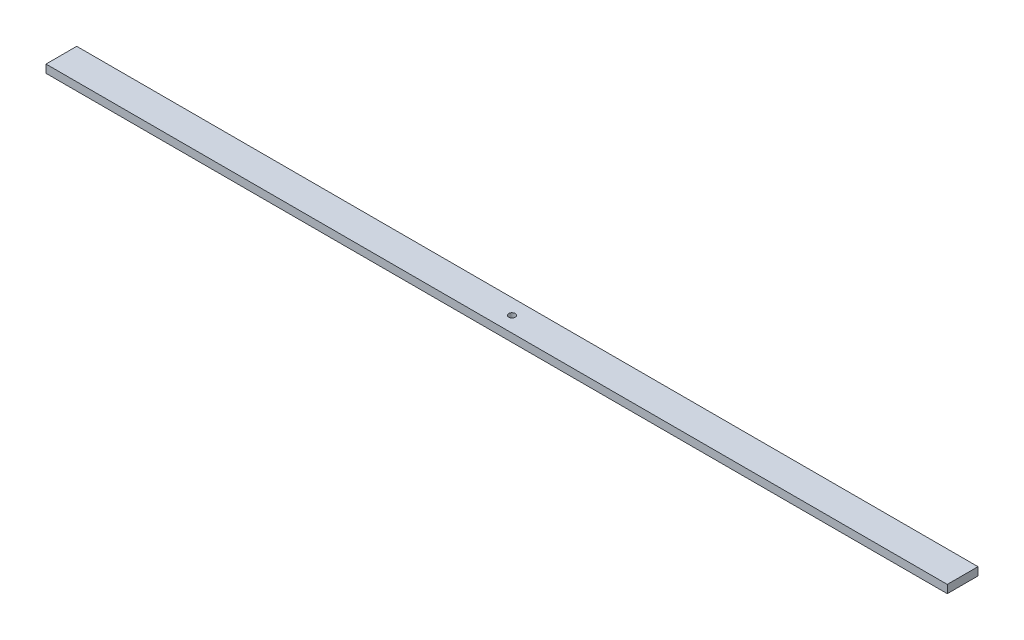
ISO-10303-21;
HEADER;
FILE_DESCRIPTION(('STEP AP214'),'2;1');
FILE_NAME('part.step','',(''),(''),'','','');
FILE_SCHEMA(('AUTOMOTIVE_DESIGN { 1 0 10303 214 1 1 1 1 }'));
ENDSEC;
DATA;
#1=APPLICATION_CONTEXT('core data for automotive mechanical design processes');
#2=APPLICATION_PROTOCOL_DEFINITION('international standard','automotive_design',2000,#1);
#3=PRODUCT_CONTEXT('',#1,'mechanical');
#4=PRODUCT('Part','Part','',(#3));
#5=PRODUCT_RELATED_PRODUCT_CATEGORY('part','',(#4));
#6=PRODUCT_DEFINITION_FORMATION('','',#4);
#7=PRODUCT_DEFINITION_CONTEXT('part definition',#1,'design');
#8=PRODUCT_DEFINITION('design','',#6,#7);
#9=PRODUCT_DEFINITION_SHAPE('','',#8);
#10=(LENGTH_UNIT() NAMED_UNIT(*) SI_UNIT(.MILLI.,.METRE.));
#11=(NAMED_UNIT(*) PLANE_ANGLE_UNIT() SI_UNIT($,.RADIAN.));
#12=(NAMED_UNIT(*) SI_UNIT($,.STERADIAN.) SOLID_ANGLE_UNIT());
#13=UNCERTAINTY_MEASURE_WITH_UNIT(LENGTH_MEASURE(1.E-05),#10,'distance_accuracy_value','');
#14=(GEOMETRIC_REPRESENTATION_CONTEXT(3) GLOBAL_UNCERTAINTY_ASSIGNED_CONTEXT((#13)) GLOBAL_UNIT_ASSIGNED_CONTEXT((#10,
#11,#12)) REPRESENTATION_CONTEXT('',''));
#15=CARTESIAN_POINT('',(0.,0.,0.));
#16=DIRECTION('',(0.,0.,1.));
#17=DIRECTION('',(1.,0.,0.));
#18=AXIS2_PLACEMENT_3D('',#15,#16,#17);
#19=CARTESIAN_POINT('',(0.,5.,0.));
#20=DIRECTION('',(0.,1.,0.));
#21=DIRECTION('',(0.,0.,1.));
#22=AXIS2_PLACEMENT_3D('',#19,#20,#21);
#23=PLANE('',#22);
#24=DIRECTION('',(0.,0.,-1.));
#25=VECTOR('',#24,1.);
#26=CARTESIAN_POINT('',(279.4,5.,-9.525));
#27=LINE('',#26,#25);
#28=CARTESIAN_POINT('',(279.4,5.,9.525));
#29=VERTEX_POINT('',#28);
#30=CARTESIAN_POINT('',(279.4,5.,-9.525));
#31=VERTEX_POINT('',#30);
#32=EDGE_CURVE('E88',#29,#31,#27,.T.);
#33=ORIENTED_EDGE('',*,*,#32,.T.);
#34=DIRECTION('',(-1.,0.,0.));
#35=VECTOR('',#34,1.);
#36=CARTESIAN_POINT('',(-279.4,5.,-9.525));
#37=LINE('',#36,#35);
#38=CARTESIAN_POINT('',(-279.4,5.,-9.525));
#39=VERTEX_POINT('',#38);
#40=EDGE_CURVE('E83',#31,#39,#37,.T.);
#41=ORIENTED_EDGE('',*,*,#40,.T.);
#42=DIRECTION('',(0.,0.,1.));
#43=VECTOR('',#42,1.);
#44=CARTESIAN_POINT('',(-279.4,5.,-9.525));
#45=LINE('',#44,#43);
#46=CARTESIAN_POINT('',(-279.4,5.,9.525));
#47=VERTEX_POINT('',#46);
#48=EDGE_CURVE('E86',#39,#47,#45,.T.);
#49=ORIENTED_EDGE('',*,*,#48,.T.);
#50=DIRECTION('',(1.,0.,0.));
#51=VECTOR('',#50,1.);
#52=CARTESIAN_POINT('',(-279.4,5.,9.525));
#53=LINE('',#52,#51);
#54=EDGE_CURVE('E53',#47,#29,#53,.T.);
#55=ORIENTED_EDGE('',*,*,#54,.T.);
#56=EDGE_LOOP('',(#33,#41,#49,#55));
#57=FACE_BOUND('',#56,.T.);
#58=CARTESIAN_POINT('',(0.,5.,0.));
#59=DIRECTION('',(0.,1.,0.));
#60=DIRECTION('',(0.,0.,1.));
#61=AXIS2_PLACEMENT_3D('',#58,#59,#60);
#62=CIRCLE('',#61,2.);
#63=CARTESIAN_POINT('',(0.,5.,2.));
#64=VERTEX_POINT('',#63);
#65=EDGE_CURVE('E103',#64,#64,#62,.T.);
#66=ORIENTED_EDGE('',*,*,#65,.F.);
#67=EDGE_LOOP('',(#66));
#68=FACE_BOUND('',#67,.T.);
#69=ADVANCED_FACE('F36',(#57,#68),#23,.T.);
#70=CARTESIAN_POINT('',(0.,0.,0.));
#71=DIRECTION('',(0.,1.,0.));
#72=DIRECTION('',(0.,0.,1.));
#73=AXIS2_PLACEMENT_3D('',#70,#71,#72);
#74=PLANE('',#73);
#75=DIRECTION('',(0.,0.,-1.));
#76=VECTOR('',#75,1.);
#77=CARTESIAN_POINT('',(279.4,0.,-9.525));
#78=LINE('',#77,#76);
#79=CARTESIAN_POINT('',(279.4,0.,9.525));
#80=VERTEX_POINT('',#79);
#81=CARTESIAN_POINT('',(279.4,0.,-9.525));
#82=VERTEX_POINT('',#81);
#83=EDGE_CURVE('E100',#80,#82,#78,.T.);
#84=ORIENTED_EDGE('',*,*,#83,.F.);
#85=DIRECTION('',(1.,0.,0.));
#86=VECTOR('',#85,1.);
#87=CARTESIAN_POINT('',(-279.4,0.,9.525));
#88=LINE('',#87,#86);
#89=CARTESIAN_POINT('',(-279.4,0.,9.525));
#90=VERTEX_POINT('',#89);
#91=EDGE_CURVE('E76',#90,#80,#88,.T.);
#92=ORIENTED_EDGE('',*,*,#91,.F.);
#93=DIRECTION('',(0.,0.,1.));
#94=VECTOR('',#93,1.);
#95=CARTESIAN_POINT('',(-279.4,0.,-9.525));
#96=LINE('',#95,#94);
#97=CARTESIAN_POINT('',(-279.4,0.,-9.525));
#98=VERTEX_POINT('',#97);
#99=EDGE_CURVE('E70',#98,#90,#96,.T.);
#100=ORIENTED_EDGE('',*,*,#99,.F.);
#101=DIRECTION('',(-1.,0.,0.));
#102=VECTOR('',#101,1.);
#103=CARTESIAN_POINT('',(-279.4,0.,-9.525));
#104=LINE('',#103,#102);
#105=EDGE_CURVE('E92',#82,#98,#104,.T.);
#106=ORIENTED_EDGE('',*,*,#105,.F.);
#107=EDGE_LOOP('',(#84,#92,#100,#106));
#108=FACE_BOUND('',#107,.T.);
#109=CARTESIAN_POINT('',(0.,0.,0.));
#110=DIRECTION('',(0.,1.,0.));
#111=DIRECTION('',(0.,0.,1.));
#112=AXIS2_PLACEMENT_3D('',#109,#110,#111);
#113=CIRCLE('',#112,2.);
#114=CARTESIAN_POINT('',(0.,0.,2.));
#115=VERTEX_POINT('',#114);
#116=EDGE_CURVE('E115',#115,#115,#113,.T.);
#117=ORIENTED_EDGE('',*,*,#116,.T.);
#118=EDGE_LOOP('',(#117));
#119=FACE_BOUND('',#118,.T.);
#120=ADVANCED_FACE('F111',(#108,#119),#74,.F.);
#121=CARTESIAN_POINT('',(279.4,5.,-9.525));
#122=DIRECTION('',(-1.,0.,0.));
#123=DIRECTION('',(0.,0.,1.));
#124=AXIS2_PLACEMENT_3D('',#121,#122,#123);
#125=PLANE('',#124);
#126=ORIENTED_EDGE('',*,*,#83,.T.);
#127=DIRECTION('',(0.,-1.,0.));
#128=VECTOR('',#127,1.);
#129=CARTESIAN_POINT('',(279.4,5.,-9.525));
#130=LINE('',#129,#128);
#131=EDGE_CURVE('E11',#31,#82,#130,.T.);
#132=ORIENTED_EDGE('',*,*,#131,.F.);
#133=ORIENTED_EDGE('',*,*,#32,.F.);
#134=DIRECTION('',(0.,-1.,0.));
#135=VECTOR('',#134,1.);
#136=CARTESIAN_POINT('',(279.4,5.,9.525));
#137=LINE('',#136,#135);
#138=EDGE_CURVE('E96',#29,#80,#137,.T.);
#139=ORIENTED_EDGE('',*,*,#138,.T.);
#140=EDGE_LOOP('',(#126,#132,#133,#139));
#141=FACE_BOUND('',#140,.T.);
#142=ADVANCED_FACE('F38',(#141),#125,.F.);
#143=CARTESIAN_POINT('',(-279.4,5.,-9.525));
#144=DIRECTION('',(0.,0.,1.));
#145=DIRECTION('',(1.,0.,0.));
#146=AXIS2_PLACEMENT_3D('',#143,#144,#145);
#147=PLANE('',#146);
#148=ORIENTED_EDGE('',*,*,#105,.T.);
#149=DIRECTION('',(0.,-1.,0.));
#150=VECTOR('',#149,1.);
#151=CARTESIAN_POINT('',(-279.4,5.,-9.525));
#152=LINE('',#151,#150);
#153=EDGE_CURVE('E45',#39,#98,#152,.T.);
#154=ORIENTED_EDGE('',*,*,#153,.F.);
#155=ORIENTED_EDGE('',*,*,#40,.F.);
#156=ORIENTED_EDGE('',*,*,#131,.T.);
#157=EDGE_LOOP('',(#148,#154,#155,#156));
#158=FACE_BOUND('',#157,.T.);
#159=ADVANCED_FACE('F91',(#158),#147,.F.);
#160=CARTESIAN_POINT('',(-279.4,5.,-9.525));
#161=DIRECTION('',(1.,0.,0.));
#162=DIRECTION('',(0.,0.,-1.));
#163=AXIS2_PLACEMENT_3D('',#160,#161,#162);
#164=PLANE('',#163);
#165=ORIENTED_EDGE('',*,*,#99,.T.);
#166=DIRECTION('',(0.,-1.,0.));
#167=VECTOR('',#166,1.);
#168=CARTESIAN_POINT('',(-279.4,5.,9.525));
#169=LINE('',#168,#167);
#170=EDGE_CURVE('E93',#47,#90,#169,.T.);
#171=ORIENTED_EDGE('',*,*,#170,.F.);
#172=ORIENTED_EDGE('',*,*,#48,.F.);
#173=ORIENTED_EDGE('',*,*,#153,.T.);
#174=EDGE_LOOP('',(#165,#171,#172,#173));
#175=FACE_BOUND('',#174,.T.);
#176=ADVANCED_FACE('F94',(#175),#164,.F.);
#177=CARTESIAN_POINT('',(-279.4,5.,9.525));
#178=DIRECTION('',(0.,0.,-1.));
#179=DIRECTION('',(-1.,0.,0.));
#180=AXIS2_PLACEMENT_3D('',#177,#178,#179);
#181=PLANE('',#180);
#182=ORIENTED_EDGE('',*,*,#91,.T.);
#183=ORIENTED_EDGE('',*,*,#138,.F.);
#184=ORIENTED_EDGE('',*,*,#54,.F.);
#185=ORIENTED_EDGE('',*,*,#170,.T.);
#186=EDGE_LOOP('',(#182,#183,#184,#185));
#187=FACE_BOUND('',#186,.T.);
#188=ADVANCED_FACE('F108',(#187),#181,.F.);
#189=CARTESIAN_POINT('',(0.,5.,0.));
#190=DIRECTION('',(0.,-1.,0.));
#191=DIRECTION('',(0.,0.,-1.));
#192=AXIS2_PLACEMENT_3D('',#189,#190,#191);
#193=CYLINDRICAL_SURFACE('',#192,2.);
#194=ORIENTED_EDGE('',*,*,#65,.T.);
#195=EDGE_LOOP('',(#194));
#196=FACE_BOUND('',#195,.T.);
#197=ORIENTED_EDGE('',*,*,#116,.F.);
#198=EDGE_LOOP('',(#197));
#199=FACE_BOUND('',#198,.T.);
#200=ADVANCED_FACE('F121',(#196,#199),#193,.F.);
#201=CLOSED_SHELL('',(#69,#120,#142,#159,#176,#188,#200));
#202=MANIFOLD_SOLID_BREP('B2',#201);
#203=ADVANCED_BREP_SHAPE_REPRESENTATION('',(#18,#202),#14);
#204=SHAPE_DEFINITION_REPRESENTATION(#9,#203);
ENDSEC;
END-ISO-10303-21;
